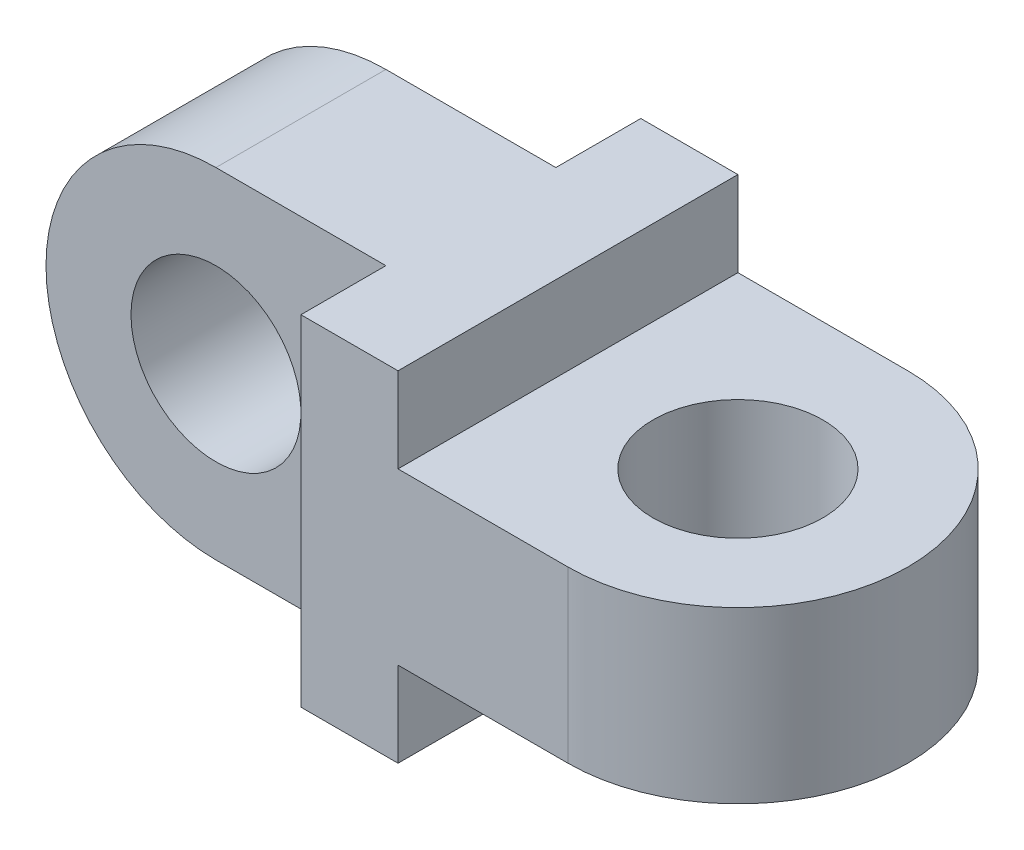
ISO-10303-21;
HEADER;
FILE_DESCRIPTION(('STEP AP214'),'2;1');
FILE_NAME('part.step','',(''),(''),'','','');
FILE_SCHEMA(('AUTOMOTIVE_DESIGN { 1 0 10303 214 1 1 1 1 }'));
ENDSEC;
DATA;
#1=APPLICATION_CONTEXT('core data for automotive mechanical design processes');
#2=APPLICATION_PROTOCOL_DEFINITION('international standard','automotive_design',2000,#1);
#3=PRODUCT_CONTEXT('',#1,'mechanical');
#4=PRODUCT('Part','Part','',(#3));
#5=PRODUCT_RELATED_PRODUCT_CATEGORY('part','',(#4));
#6=PRODUCT_DEFINITION_FORMATION('','',#4);
#7=PRODUCT_DEFINITION_CONTEXT('part definition',#1,'design');
#8=PRODUCT_DEFINITION('design','',#6,#7);
#9=PRODUCT_DEFINITION_SHAPE('','',#8);
#10=(LENGTH_UNIT() NAMED_UNIT(*) SI_UNIT(.MILLI.,.METRE.));
#11=(NAMED_UNIT(*) PLANE_ANGLE_UNIT() SI_UNIT($,.RADIAN.));
#12=(NAMED_UNIT(*) SI_UNIT($,.STERADIAN.) SOLID_ANGLE_UNIT());
#13=UNCERTAINTY_MEASURE_WITH_UNIT(LENGTH_MEASURE(1.E-05),#10,'distance_accuracy_value','');
#14=(GEOMETRIC_REPRESENTATION_CONTEXT(3) GLOBAL_UNCERTAINTY_ASSIGNED_CONTEXT((#13)) GLOBAL_UNIT_ASSIGNED_CONTEXT((#10,
#11,#12)) REPRESENTATION_CONTEXT('',''));
#15=CARTESIAN_POINT('',(0.,0.,0.));
#16=DIRECTION('',(0.,0.,1.));
#17=DIRECTION('',(1.,0.,0.));
#18=AXIS2_PLACEMENT_3D('',#15,#16,#17);
#19=CARTESIAN_POINT('',(-8.,0.,0.));
#20=DIRECTION('',(1.,0.,0.));
#21=DIRECTION('',(0.,0.,-1.));
#22=AXIS2_PLACEMENT_3D('',#19,#20,#21);
#23=PLANE('',#22);
#24=DIRECTION('',(0.,-1.,0.));
#25=VECTOR('',#24,1.);
#26=CARTESIAN_POINT('',(-8.,14.,-7.));
#27=LINE('',#26,#25);
#28=CARTESIAN_POINT('',(-8.,14.,-7.));
#29=VERTEX_POINT('',#28);
#30=CARTESIAN_POINT('',(-8.,-14.,-7.));
#31=VERTEX_POINT('',#30);
#32=EDGE_CURVE('E62',#29,#31,#27,.T.);
#33=ORIENTED_EDGE('',*,*,#32,.F.);
#34=DIRECTION('',(0.,0.,-1.));
#35=VECTOR('',#34,1.);
#36=CARTESIAN_POINT('',(-8.,14.,-14.));
#37=LINE('',#36,#35);
#38=CARTESIAN_POINT('',(-8.,14.,-14.));
#39=VERTEX_POINT('',#38);
#40=EDGE_CURVE('E171',#29,#39,#37,.T.);
#41=ORIENTED_EDGE('',*,*,#40,.T.);
#42=DIRECTION('',(0.,-1.,0.));
#43=VECTOR('',#42,1.);
#44=CARTESIAN_POINT('',(-8.,-14.,-14.));
#45=LINE('',#44,#43);
#46=CARTESIAN_POINT('',(-8.,-14.,-14.));
#47=VERTEX_POINT('',#46);
#48=EDGE_CURVE('E128',#39,#47,#45,.T.);
#49=ORIENTED_EDGE('',*,*,#48,.T.);
#50=DIRECTION('',(0.,0.,1.));
#51=VECTOR('',#50,1.);
#52=CARTESIAN_POINT('',(-8.,-14.,-14.));
#53=LINE('',#52,#51);
#54=EDGE_CURVE('E126',#47,#31,#53,.T.);
#55=ORIENTED_EDGE('',*,*,#54,.T.);
#56=EDGE_LOOP('',(#33,#41,#49,#55));
#57=FACE_BOUND('',#56,.T.);
#58=ADVANCED_FACE('F39',(#57),#23,.F.);
#59=CARTESIAN_POINT('',(14.,7.,0.));
#60=DIRECTION('',(0.,1.,0.));
#61=DIRECTION('',(0.,0.,1.));
#62=AXIS2_PLACEMENT_3D('',#59,#60,#61);
#63=PLANE('',#62);
#64=DIRECTION('',(-1.,0.,0.));
#65=VECTOR('',#64,1.);
#66=CARTESIAN_POINT('',(14.,7.,-14.));
#67=LINE('',#66,#65);
#68=CARTESIAN_POINT('',(14.,7.,-14.));
#69=VERTEX_POINT('',#68);
#70=CARTESIAN_POINT('',(0.,7.,-14.));
#71=VERTEX_POINT('',#70);
#72=EDGE_CURVE('E203',#69,#71,#67,.T.);
#73=ORIENTED_EDGE('',*,*,#72,.T.);
#74=DIRECTION('',(0.,0.,1.));
#75=VECTOR('',#74,1.);
#76=CARTESIAN_POINT('',(0.,7.,-14.));
#77=LINE('',#76,#75);
#78=CARTESIAN_POINT('',(0.,7.,14.));
#79=VERTEX_POINT('',#78);
#80=EDGE_CURVE('E206',#71,#79,#77,.T.);
#81=ORIENTED_EDGE('',*,*,#80,.T.);
#82=DIRECTION('',(1.,0.,0.));
#83=VECTOR('',#82,1.);
#84=CARTESIAN_POINT('',(0.,7.,14.));
#85=LINE('',#84,#83);
#86=CARTESIAN_POINT('',(14.,7.,14.));
#87=VERTEX_POINT('',#86);
#88=EDGE_CURVE('E210',#79,#87,#85,.T.);
#89=ORIENTED_EDGE('',*,*,#88,.T.);
#90=CARTESIAN_POINT('',(14.,7.,0.));
#91=DIRECTION('',(0.,1.,0.));
#92=DIRECTION('',(0.,0.,1.));
#93=AXIS2_PLACEMENT_3D('',#90,#91,#92);
#94=CIRCLE('',#93,14.);
#95=EDGE_CURVE('E212',#87,#69,#94,.T.);
#96=ORIENTED_EDGE('',*,*,#95,.T.);
#97=EDGE_LOOP('',(#73,#81,#89,#96));
#98=FACE_BOUND('',#97,.T.);
#99=CARTESIAN_POINT('',(14.,7.,0.));
#100=DIRECTION('',(0.,1.,0.));
#101=DIRECTION('',(0.,0.,1.));
#102=AXIS2_PLACEMENT_3D('',#99,#100,#101);
#103=CIRCLE('',#102,7.);
#104=CARTESIAN_POINT('',(14.,7.,7.));
#105=VERTEX_POINT('',#104);
#106=EDGE_CURVE('E197',#105,#105,#103,.T.);
#107=ORIENTED_EDGE('',*,*,#106,.F.);
#108=EDGE_LOOP('',(#107));
#109=FACE_BOUND('',#108,.T.);
#110=ADVANCED_FACE('F252',(#98,#109),#63,.T.);
#111=CARTESIAN_POINT('',(14.,-7.,0.));
#112=DIRECTION('',(0.,1.,0.));
#113=DIRECTION('',(0.,0.,1.));
#114=AXIS2_PLACEMENT_3D('',#111,#112,#113);
#115=PLANE('',#114);
#116=DIRECTION('',(-1.,0.,0.));
#117=VECTOR('',#116,1.);
#118=CARTESIAN_POINT('',(14.,-7.,-14.));
#119=LINE('',#118,#117);
#120=CARTESIAN_POINT('',(14.,-7.,-14.));
#121=VERTEX_POINT('',#120);
#122=CARTESIAN_POINT('',(0.,-7.,-14.));
#123=VERTEX_POINT('',#122);
#124=EDGE_CURVE('E200',#121,#123,#119,.T.);
#125=ORIENTED_EDGE('',*,*,#124,.F.);
#126=CARTESIAN_POINT('',(14.,-7.,0.));
#127=DIRECTION('',(0.,1.,0.));
#128=DIRECTION('',(0.,0.,1.));
#129=AXIS2_PLACEMENT_3D('',#126,#127,#128);
#130=CIRCLE('',#129,14.);
#131=CARTESIAN_POINT('',(14.,-7.,14.));
#132=VERTEX_POINT('',#131);
#133=EDGE_CURVE('E207',#132,#121,#130,.T.);
#134=ORIENTED_EDGE('',*,*,#133,.F.);
#135=DIRECTION('',(1.,0.,0.));
#136=VECTOR('',#135,1.);
#137=CARTESIAN_POINT('',(0.,-7.,14.));
#138=LINE('',#137,#136);
#139=CARTESIAN_POINT('',(0.,-7.,14.));
#140=VERTEX_POINT('',#139);
#141=EDGE_CURVE('E218',#140,#132,#138,.T.);
#142=ORIENTED_EDGE('',*,*,#141,.F.);
#143=DIRECTION('',(0.,0.,1.));
#144=VECTOR('',#143,1.);
#145=CARTESIAN_POINT('',(0.,-7.,-14.));
#146=LINE('',#145,#144);
#147=EDGE_CURVE('E216',#123,#140,#146,.T.);
#148=ORIENTED_EDGE('',*,*,#147,.F.);
#149=EDGE_LOOP('',(#125,#134,#142,#148));
#150=FACE_BOUND('',#149,.T.);
#151=CARTESIAN_POINT('',(14.,-7.,0.));
#152=DIRECTION('',(0.,1.,0.));
#153=DIRECTION('',(0.,0.,1.));
#154=AXIS2_PLACEMENT_3D('',#151,#152,#153);
#155=CIRCLE('',#154,7.);
#156=CARTESIAN_POINT('',(14.,-7.,7.));
#157=VERTEX_POINT('',#156);
#158=EDGE_CURVE('E196',#157,#157,#155,.T.);
#159=ORIENTED_EDGE('',*,*,#158,.T.);
#160=EDGE_LOOP('',(#159));
#161=FACE_BOUND('',#160,.T.);
#162=ADVANCED_FACE('F230',(#150,#161),#115,.F.);
#163=CARTESIAN_POINT('',(14.,7.,-14.));
#164=DIRECTION('',(0.,0.,1.));
#165=DIRECTION('',(1.,0.,0.));
#166=AXIS2_PLACEMENT_3D('',#163,#164,#165);
#167=PLANE('',#166);
#168=ORIENTED_EDGE('',*,*,#124,.T.);
#169=DIRECTION('',(0.,-1.,0.));
#170=VECTOR('',#169,1.);
#171=CARTESIAN_POINT('',(0.,-14.,-14.));
#172=LINE('',#171,#170);
#173=CARTESIAN_POINT('',(0.,-14.,-14.));
#174=VERTEX_POINT('',#173);
#175=EDGE_CURVE('E181',#123,#174,#172,.T.);
#176=ORIENTED_EDGE('',*,*,#175,.T.);
#177=DIRECTION('',(1.,0.,0.));
#178=VECTOR('',#177,1.);
#179=CARTESIAN_POINT('',(-8.,-14.,-14.));
#180=LINE('',#179,#178);
#181=EDGE_CURVE('E188',#47,#174,#180,.T.);
#182=ORIENTED_EDGE('',*,*,#181,.F.);
#183=ORIENTED_EDGE('',*,*,#48,.F.);
#184=DIRECTION('',(1.,0.,0.));
#185=VECTOR('',#184,1.);
#186=CARTESIAN_POINT('',(-8.,14.,-14.));
#187=LINE('',#186,#185);
#188=CARTESIAN_POINT('',(0.,14.,-14.));
#189=VERTEX_POINT('',#188);
#190=EDGE_CURVE('E190',#39,#189,#187,.T.);
#191=ORIENTED_EDGE('',*,*,#190,.T.);
#192=EDGE_CURVE('E182',#189,#71,#172,.T.);
#193=ORIENTED_EDGE('',*,*,#192,.T.);
#194=ORIENTED_EDGE('',*,*,#72,.F.);
#195=DIRECTION('',(0.,-1.,0.));
#196=VECTOR('',#195,1.);
#197=CARTESIAN_POINT('',(14.,7.,-14.));
#198=LINE('',#197,#196);
#199=EDGE_CURVE('E47',#69,#121,#198,.T.);
#200=ORIENTED_EDGE('',*,*,#199,.T.);
#201=EDGE_LOOP('',(#168,#176,#182,#183,#191,#193,#194,#200));
#202=FACE_BOUND('',#201,.T.);
#203=ADVANCED_FACE('F41',(#202),#167,.F.);
#204=CARTESIAN_POINT('',(0.,7.,14.));
#205=DIRECTION('',(0.,0.,-1.));
#206=DIRECTION('',(-1.,0.,0.));
#207=AXIS2_PLACEMENT_3D('',#204,#205,#206);
#208=PLANE('',#207);
#209=ORIENTED_EDGE('',*,*,#141,.T.);
#210=DIRECTION('',(0.,-1.,0.));
#211=VECTOR('',#210,1.);
#212=CARTESIAN_POINT('',(14.,7.,14.));
#213=LINE('',#212,#211);
#214=EDGE_CURVE('E11',#87,#132,#213,.T.);
#215=ORIENTED_EDGE('',*,*,#214,.F.);
#216=ORIENTED_EDGE('',*,*,#88,.F.);
#217=DIRECTION('',(0.,1.,0.));
#218=VECTOR('',#217,1.);
#219=CARTESIAN_POINT('',(0.,-14.,14.));
#220=LINE('',#219,#218);
#221=CARTESIAN_POINT('',(0.,14.,14.));
#222=VERTEX_POINT('',#221);
#223=EDGE_CURVE('E167',#79,#222,#220,.T.);
#224=ORIENTED_EDGE('',*,*,#223,.T.);
#225=DIRECTION('',(1.,0.,0.));
#226=VECTOR('',#225,1.);
#227=CARTESIAN_POINT('',(-8.,14.,14.));
#228=LINE('',#227,#226);
#229=CARTESIAN_POINT('',(-8.,14.,14.));
#230=VERTEX_POINT('',#229);
#231=EDGE_CURVE('E193',#230,#222,#228,.T.);
#232=ORIENTED_EDGE('',*,*,#231,.F.);
#233=DIRECTION('',(0.,1.,0.));
#234=VECTOR('',#233,1.);
#235=CARTESIAN_POINT('',(-8.,-14.,14.));
#236=LINE('',#235,#234);
#237=CARTESIAN_POINT('',(-8.,-14.,14.));
#238=VERTEX_POINT('',#237);
#239=EDGE_CURVE('E168',#238,#230,#236,.T.);
#240=ORIENTED_EDGE('',*,*,#239,.F.);
#241=DIRECTION('',(1.,0.,0.));
#242=VECTOR('',#241,1.);
#243=CARTESIAN_POINT('',(-8.,-14.,14.));
#244=LINE('',#243,#242);
#245=CARTESIAN_POINT('',(0.,-14.,14.));
#246=VERTEX_POINT('',#245);
#247=EDGE_CURVE('E133',#238,#246,#244,.T.);
#248=ORIENTED_EDGE('',*,*,#247,.T.);
#249=EDGE_CURVE('E176',#246,#140,#220,.T.);
#250=ORIENTED_EDGE('',*,*,#249,.T.);
#251=EDGE_LOOP('',(#209,#215,#216,#224,#232,#240,#248,#250));
#252=FACE_BOUND('',#251,.T.);
#253=ADVANCED_FACE('F238',(#252),#208,.F.);
#254=CARTESIAN_POINT('',(14.,7.,0.));
#255=DIRECTION('',(0.,-1.,0.));
#256=DIRECTION('',(0.,0.,-1.));
#257=AXIS2_PLACEMENT_3D('',#254,#255,#256);
#258=CYLINDRICAL_SURFACE('',#257,14.);
#259=ORIENTED_EDGE('',*,*,#133,.T.);
#260=ORIENTED_EDGE('',*,*,#199,.F.);
#261=ORIENTED_EDGE('',*,*,#95,.F.);
#262=ORIENTED_EDGE('',*,*,#214,.T.);
#263=EDGE_LOOP('',(#259,#260,#261,#262));
#264=FACE_BOUND('',#263,.T.);
#265=ADVANCED_FACE('F254',(#264),#258,.T.);
#266=CARTESIAN_POINT('',(14.,7.,0.));
#267=DIRECTION('',(0.,-1.,0.));
#268=DIRECTION('',(0.,0.,-1.));
#269=AXIS2_PLACEMENT_3D('',#266,#267,#268);
#270=CYLINDRICAL_SURFACE('',#269,7.);
#271=ORIENTED_EDGE('',*,*,#106,.T.);
#272=EDGE_LOOP('',(#271));
#273=FACE_BOUND('',#272,.T.);
#274=ORIENTED_EDGE('',*,*,#158,.F.);
#275=EDGE_LOOP('',(#274));
#276=FACE_BOUND('',#275,.T.);
#277=ADVANCED_FACE('F256',(#273,#276),#270,.F.);
#278=CARTESIAN_POINT('',(0.,0.,0.));
#279=DIRECTION('',(1.,0.,0.));
#280=DIRECTION('',(0.,0.,-1.));
#281=AXIS2_PLACEMENT_3D('',#278,#279,#280);
#282=PLANE('',#281);
#283=ORIENTED_EDGE('',*,*,#80,.F.);
#284=ORIENTED_EDGE('',*,*,#192,.F.);
#285=DIRECTION('',(0.,0.,-1.));
#286=VECTOR('',#285,1.);
#287=CARTESIAN_POINT('',(0.,14.,-14.));
#288=LINE('',#287,#286);
#289=EDGE_CURVE('E179',#222,#189,#288,.T.);
#290=ORIENTED_EDGE('',*,*,#289,.F.);
#291=ORIENTED_EDGE('',*,*,#223,.F.);
#292=EDGE_LOOP('',(#283,#284,#290,#291));
#293=FACE_BOUND('',#292,.T.);
#294=ADVANCED_FACE('F249',(#293),#282,.T.);
#295=CARTESIAN_POINT('',(-8.,14.,-14.));
#296=DIRECTION('',(0.,-1.,0.));
#297=DIRECTION('',(0.,0.,-1.));
#298=AXIS2_PLACEMENT_3D('',#295,#296,#297);
#299=PLANE('',#298);
#300=ORIENTED_EDGE('',*,*,#289,.T.);
#301=ORIENTED_EDGE('',*,*,#190,.F.);
#302=ORIENTED_EDGE('',*,*,#40,.F.);
#303=DIRECTION('',(1.,0.,0.));
#304=VECTOR('',#303,1.);
#305=CARTESIAN_POINT('',(-8.,14.,-7.));
#306=LINE('',#305,#304);
#307=CARTESIAN_POINT('',(-22.,14.,-7.));
#308=VERTEX_POINT('',#307);
#309=EDGE_CURVE('E143',#308,#29,#306,.T.);
#310=ORIENTED_EDGE('',*,*,#309,.F.);
#311=DIRECTION('',(0.,0.,1.));
#312=VECTOR('',#311,1.);
#313=CARTESIAN_POINT('',(-22.,14.,-7.));
#314=LINE('',#313,#312);
#315=CARTESIAN_POINT('',(-22.,14.,7.));
#316=VERTEX_POINT('',#315);
#317=EDGE_CURVE('E151',#308,#316,#314,.T.);
#318=ORIENTED_EDGE('',*,*,#317,.T.);
#319=DIRECTION('',(1.,0.,0.));
#320=VECTOR('',#319,1.);
#321=CARTESIAN_POINT('',(-8.,14.,7.));
#322=LINE('',#321,#320);
#323=CARTESIAN_POINT('',(-8.,14.,7.));
#324=VERTEX_POINT('',#323);
#325=EDGE_CURVE('E155',#316,#324,#322,.T.);
#326=ORIENTED_EDGE('',*,*,#325,.T.);
#327=EDGE_CURVE('E173',#230,#324,#37,.T.);
#328=ORIENTED_EDGE('',*,*,#327,.F.);
#329=ORIENTED_EDGE('',*,*,#231,.T.);
#330=EDGE_LOOP('',(#300,#301,#302,#310,#318,#326,#328,#329));
#331=FACE_BOUND('',#330,.T.);
#332=ADVANCED_FACE('F281',(#331),#299,.F.);
#333=CARTESIAN_POINT('',(-8.,-14.,-14.));
#334=DIRECTION('',(0.,1.,0.));
#335=DIRECTION('',(0.,0.,1.));
#336=AXIS2_PLACEMENT_3D('',#333,#334,#335);
#337=PLANE('',#336);
#338=DIRECTION('',(0.,0.,1.));
#339=VECTOR('',#338,1.);
#340=CARTESIAN_POINT('',(0.,-14.,-14.));
#341=LINE('',#340,#339);
#342=EDGE_CURVE('E172',#174,#246,#341,.T.);
#343=ORIENTED_EDGE('',*,*,#342,.T.);
#344=ORIENTED_EDGE('',*,*,#247,.F.);
#345=CARTESIAN_POINT('',(-8.,-14.,7.));
#346=VERTEX_POINT('',#345);
#347=EDGE_CURVE('E134',#346,#238,#53,.T.);
#348=ORIENTED_EDGE('',*,*,#347,.F.);
#349=DIRECTION('',(-1.,0.,0.));
#350=VECTOR('',#349,1.);
#351=CARTESIAN_POINT('',(-22.,-14.,7.));
#352=LINE('',#351,#350);
#353=CARTESIAN_POINT('',(-22.,-14.,7.));
#354=VERTEX_POINT('',#353);
#355=EDGE_CURVE('E160',#346,#354,#352,.T.);
#356=ORIENTED_EDGE('',*,*,#355,.T.);
#357=DIRECTION('',(0.,0.,1.));
#358=VECTOR('',#357,1.);
#359=CARTESIAN_POINT('',(-22.,-14.,-7.));
#360=LINE('',#359,#358);
#361=CARTESIAN_POINT('',(-22.,-14.,-7.));
#362=VERTEX_POINT('',#361);
#363=EDGE_CURVE('E147',#362,#354,#360,.T.);
#364=ORIENTED_EDGE('',*,*,#363,.F.);
#365=DIRECTION('',(-1.,0.,0.));
#366=VECTOR('',#365,1.);
#367=CARTESIAN_POINT('',(-22.,-14.,-7.));
#368=LINE('',#367,#366);
#369=EDGE_CURVE('E140',#31,#362,#368,.T.);
#370=ORIENTED_EDGE('',*,*,#369,.F.);
#371=ORIENTED_EDGE('',*,*,#54,.F.);
#372=ORIENTED_EDGE('',*,*,#181,.T.);
#373=EDGE_LOOP('',(#343,#344,#348,#356,#364,#370,#371,#372));
#374=FACE_BOUND('',#373,.T.);
#375=ADVANCED_FACE('F145',(#374),#337,.F.);
#376=ORIENTED_EDGE('',*,*,#327,.T.);
#377=DIRECTION('',(0.,-1.,0.));
#378=VECTOR('',#377,1.);
#379=CARTESIAN_POINT('',(-8.,14.,7.));
#380=LINE('',#379,#378);
#381=EDGE_CURVE('E54',#324,#346,#380,.T.);
#382=ORIENTED_EDGE('',*,*,#381,.T.);
#383=ORIENTED_EDGE('',*,*,#347,.T.);
#384=ORIENTED_EDGE('',*,*,#239,.T.);
#385=EDGE_LOOP('',(#376,#382,#383,#384));
#386=FACE_BOUND('',#385,.T.);
#387=ADVANCED_FACE('F267',(#386),#23,.F.);
#388=ORIENTED_EDGE('',*,*,#175,.F.);
#389=ORIENTED_EDGE('',*,*,#147,.T.);
#390=ORIENTED_EDGE('',*,*,#249,.F.);
#391=ORIENTED_EDGE('',*,*,#342,.F.);
#392=EDGE_LOOP('',(#388,#389,#390,#391));
#393=FACE_BOUND('',#392,.T.);
#394=ADVANCED_FACE('F235',(#393),#282,.T.);
#395=CARTESIAN_POINT('',(-22.,0.,-7.));
#396=DIRECTION('',(0.,0.,1.));
#397=DIRECTION('',(1.,0.,0.));
#398=AXIS2_PLACEMENT_3D('',#395,#396,#397);
#399=PLANE('',#398);
#400=ORIENTED_EDGE('',*,*,#309,.T.);
#401=ORIENTED_EDGE('',*,*,#32,.T.);
#402=ORIENTED_EDGE('',*,*,#369,.T.);
#403=CARTESIAN_POINT('',(-22.,0.,-7.));
#404=DIRECTION('',(0.,0.,-1.));
#405=DIRECTION('',(1.,0.,0.));
#406=AXIS2_PLACEMENT_3D('',#403,#404,#405);
#407=CIRCLE('',#406,14.);
#408=EDGE_CURVE('E149',#362,#308,#407,.T.);
#409=ORIENTED_EDGE('',*,*,#408,.T.);
#410=EDGE_LOOP('',(#400,#401,#402,#409));
#411=FACE_BOUND('',#410,.T.);
#412=CARTESIAN_POINT('',(-22.,0.,-7.));
#413=DIRECTION('',(0.,0.,-1.));
#414=DIRECTION('',(-1.,0.,0.));
#415=AXIS2_PLACEMENT_3D('',#412,#413,#414);
#416=CIRCLE('',#415,7.);
#417=CARTESIAN_POINT('',(-29.,0.,-7.));
#418=VERTEX_POINT('',#417);
#419=EDGE_CURVE('E158',#418,#418,#416,.T.);
#420=ORIENTED_EDGE('',*,*,#419,.F.);
#421=EDGE_LOOP('',(#420));
#422=FACE_BOUND('',#421,.T.);
#423=ADVANCED_FACE('F138',(#411,#422),#399,.F.);
#424=CARTESIAN_POINT('',(-22.,0.,7.));
#425=DIRECTION('',(0.,0.,1.));
#426=DIRECTION('',(1.,0.,0.));
#427=AXIS2_PLACEMENT_3D('',#424,#425,#426);
#428=PLANE('',#427);
#429=ORIENTED_EDGE('',*,*,#325,.F.);
#430=CARTESIAN_POINT('',(-22.,0.,7.));
#431=DIRECTION('',(0.,0.,-1.));
#432=DIRECTION('',(1.,0.,0.));
#433=AXIS2_PLACEMENT_3D('',#430,#431,#432);
#434=CIRCLE('',#433,14.);
#435=EDGE_CURVE('E162',#354,#316,#434,.T.);
#436=ORIENTED_EDGE('',*,*,#435,.F.);
#437=ORIENTED_EDGE('',*,*,#355,.F.);
#438=ORIENTED_EDGE('',*,*,#381,.F.);
#439=EDGE_LOOP('',(#429,#436,#437,#438));
#440=FACE_BOUND('',#439,.T.);
#441=CARTESIAN_POINT('',(-22.,0.,7.));
#442=DIRECTION('',(0.,0.,-1.));
#443=DIRECTION('',(-1.,0.,0.));
#444=AXIS2_PLACEMENT_3D('',#441,#442,#443);
#445=CIRCLE('',#444,7.);
#446=CARTESIAN_POINT('',(-29.,0.,7.));
#447=VERTEX_POINT('',#446);
#448=EDGE_CURVE('E410',#447,#447,#445,.T.);
#449=ORIENTED_EDGE('',*,*,#448,.T.);
#450=EDGE_LOOP('',(#449));
#451=FACE_BOUND('',#450,.T.);
#452=ADVANCED_FACE('F285',(#440,#451),#428,.T.);
#453=CARTESIAN_POINT('',(-22.,0.,-7.));
#454=DIRECTION('',(0.,0.,1.));
#455=DIRECTION('',(1.,0.,0.));
#456=AXIS2_PLACEMENT_3D('',#453,#454,#455);
#457=CYLINDRICAL_SURFACE('',#456,14.);
#458=ORIENTED_EDGE('',*,*,#435,.T.);
#459=ORIENTED_EDGE('',*,*,#317,.F.);
#460=ORIENTED_EDGE('',*,*,#408,.F.);
#461=ORIENTED_EDGE('',*,*,#363,.T.);
#462=EDGE_LOOP('',(#458,#459,#460,#461));
#463=FACE_BOUND('',#462,.T.);
#464=ADVANCED_FACE('F290',(#463),#457,.T.);
#465=CARTESIAN_POINT('',(-22.,0.,-7.));
#466=DIRECTION('',(0.,0.,1.));
#467=DIRECTION('',(1.,0.,0.));
#468=AXIS2_PLACEMENT_3D('',#465,#466,#467);
#469=CYLINDRICAL_SURFACE('',#468,7.);
#470=ORIENTED_EDGE('',*,*,#419,.T.);
#471=EDGE_LOOP('',(#470));
#472=FACE_BOUND('',#471,.T.);
#473=ORIENTED_EDGE('',*,*,#448,.F.);
#474=EDGE_LOOP('',(#473));
#475=FACE_BOUND('',#474,.T.);
#476=ADVANCED_FACE('F292',(#472,#475),#469,.F.);
#477=CLOSED_SHELL('',(#58,#110,#162,#203,#253,#265,#277,#294,#332,#375,#387,#394,#423,#452,#464,#476));
#478=MANIFOLD_SOLID_BREP('B2',#477);
#479=ADVANCED_BREP_SHAPE_REPRESENTATION('',(#18,#478),#14);
#480=SHAPE_DEFINITION_REPRESENTATION(#9,#479);
ENDSEC;
END-ISO-10303-21;
